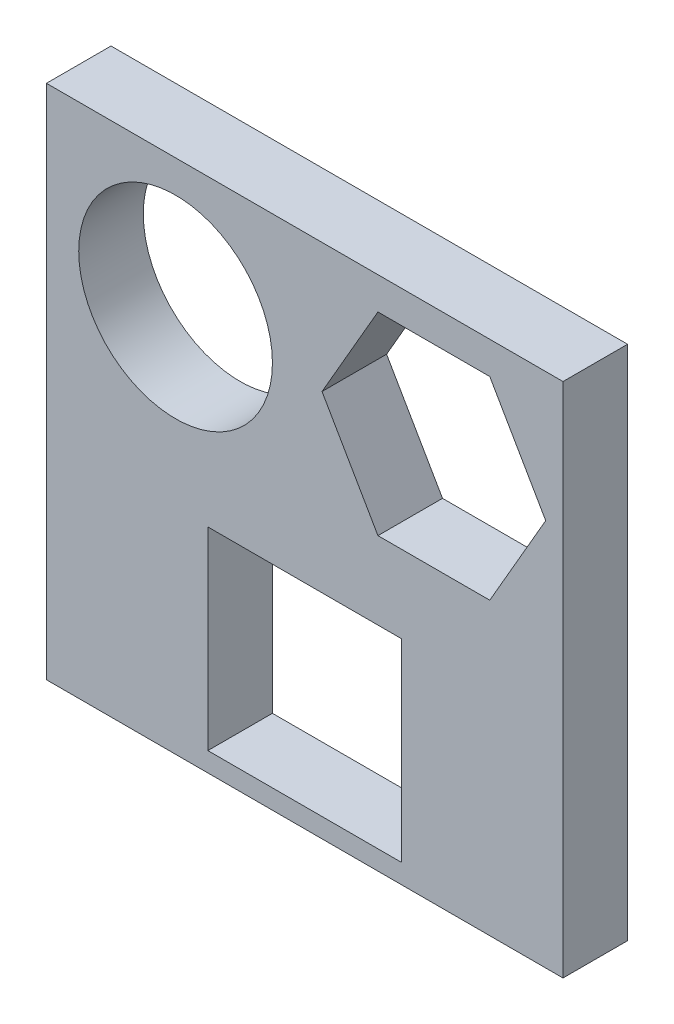
ISO-10303-21;
HEADER;
FILE_DESCRIPTION(('STEP AP214'),'2;1');
FILE_NAME('part.step','',(''),(''),'','','');
FILE_SCHEMA(('AUTOMOTIVE_DESIGN { 1 0 10303 214 1 1 1 1 }'));
ENDSEC;
DATA;
#1=APPLICATION_CONTEXT('core data for automotive mechanical design processes');
#2=APPLICATION_PROTOCOL_DEFINITION('international standard','automotive_design',2000,#1);
#3=PRODUCT_CONTEXT('',#1,'mechanical');
#4=PRODUCT('Part','Part','',(#3));
#5=PRODUCT_RELATED_PRODUCT_CATEGORY('part','',(#4));
#6=PRODUCT_DEFINITION_FORMATION('','',#4);
#7=PRODUCT_DEFINITION_CONTEXT('part definition',#1,'design');
#8=PRODUCT_DEFINITION('design','',#6,#7);
#9=PRODUCT_DEFINITION_SHAPE('','',#8);
#10=(LENGTH_UNIT() NAMED_UNIT(*) SI_UNIT(.MILLI.,.METRE.));
#11=(NAMED_UNIT(*) PLANE_ANGLE_UNIT() SI_UNIT($,.RADIAN.));
#12=(NAMED_UNIT(*) SI_UNIT($,.STERADIAN.) SOLID_ANGLE_UNIT());
#13=UNCERTAINTY_MEASURE_WITH_UNIT(LENGTH_MEASURE(1.E-05),#10,'distance_accuracy_value','');
#14=(GEOMETRIC_REPRESENTATION_CONTEXT(3) GLOBAL_UNCERTAINTY_ASSIGNED_CONTEXT((#13)) GLOBAL_UNIT_ASSIGNED_CONTEXT((#10,
#11,#12)) REPRESENTATION_CONTEXT('',''));
#15=CARTESIAN_POINT('',(0.,0.,0.));
#16=DIRECTION('',(0.,0.,1.));
#17=DIRECTION('',(1.,0.,0.));
#18=AXIS2_PLACEMENT_3D('',#15,#16,#17);
#19=CARTESIAN_POINT('',(40.,-40.,-10.));
#20=DIRECTION('',(1.,0.,0.));
#21=DIRECTION('',(0.,0.,-1.));
#22=AXIS2_PLACEMENT_3D('',#19,#20,#21);
#23=PLANE('',#22);
#24=DIRECTION('',(0.,1.,0.));
#25=VECTOR('',#24,1.);
#26=CARTESIAN_POINT('',(40.,-40.,0.));
#27=LINE('',#26,#25);
#28=CARTESIAN_POINT('',(40.,-40.,0.));
#29=VERTEX_POINT('',#28);
#30=CARTESIAN_POINT('',(40.,40.,0.));
#31=VERTEX_POINT('',#30);
#32=EDGE_CURVE('E260',#29,#31,#27,.T.);
#33=ORIENTED_EDGE('',*,*,#32,.F.);
#34=DIRECTION('',(0.,0.,1.));
#35=VECTOR('',#34,1.);
#36=CARTESIAN_POINT('',(40.,-40.,-10.));
#37=LINE('',#36,#35);
#38=CARTESIAN_POINT('',(40.,-40.,-10.));
#39=VERTEX_POINT('',#38);
#40=EDGE_CURVE('E11',#39,#29,#37,.T.);
#41=ORIENTED_EDGE('',*,*,#40,.F.);
#42=DIRECTION('',(0.,1.,0.));
#43=VECTOR('',#42,1.);
#44=CARTESIAN_POINT('',(40.,-40.,-10.));
#45=LINE('',#44,#43);
#46=CARTESIAN_POINT('',(40.,40.,-10.));
#47=VERTEX_POINT('',#46);
#48=EDGE_CURVE('E264',#39,#47,#45,.T.);
#49=ORIENTED_EDGE('',*,*,#48,.T.);
#50=DIRECTION('',(0.,0.,1.));
#51=VECTOR('',#50,1.);
#52=CARTESIAN_POINT('',(40.,40.,-10.));
#53=LINE('',#52,#51);
#54=EDGE_CURVE('E42',#47,#31,#53,.T.);
#55=ORIENTED_EDGE('',*,*,#54,.T.);
#56=EDGE_LOOP('',(#33,#41,#49,#55));
#57=FACE_BOUND('',#56,.T.);
#58=ADVANCED_FACE('F39',(#57),#23,.T.);
#59=CARTESIAN_POINT('',(-40.,-40.,-10.));
#60=DIRECTION('',(0.,-1.,0.));
#61=DIRECTION('',(0.,0.,-1.));
#62=AXIS2_PLACEMENT_3D('',#59,#60,#61);
#63=PLANE('',#62);
#64=DIRECTION('',(1.,0.,0.));
#65=VECTOR('',#64,1.);
#66=CARTESIAN_POINT('',(-40.,-40.,0.));
#67=LINE('',#66,#65);
#68=CARTESIAN_POINT('',(-40.,-40.,0.));
#69=VERTEX_POINT('',#68);
#70=EDGE_CURVE('E269',#69,#29,#67,.T.);
#71=ORIENTED_EDGE('',*,*,#70,.F.);
#72=DIRECTION('',(0.,0.,1.));
#73=VECTOR('',#72,1.);
#74=CARTESIAN_POINT('',(-40.,-40.,-10.));
#75=LINE('',#74,#73);
#76=CARTESIAN_POINT('',(-40.,-40.,-10.));
#77=VERTEX_POINT('',#76);
#78=EDGE_CURVE('E48',#77,#69,#75,.T.);
#79=ORIENTED_EDGE('',*,*,#78,.F.);
#80=DIRECTION('',(1.,0.,0.));
#81=VECTOR('',#80,1.);
#82=CARTESIAN_POINT('',(-40.,-40.,-10.));
#83=LINE('',#82,#81);
#84=EDGE_CURVE('E277',#77,#39,#83,.T.);
#85=ORIENTED_EDGE('',*,*,#84,.T.);
#86=ORIENTED_EDGE('',*,*,#40,.T.);
#87=EDGE_LOOP('',(#71,#79,#85,#86));
#88=FACE_BOUND('',#87,.T.);
#89=ADVANCED_FACE('F311',(#88),#63,.T.);
#90=CARTESIAN_POINT('',(-40.,-40.,-10.));
#91=DIRECTION('',(-1.,0.,0.));
#92=DIRECTION('',(0.,0.,1.));
#93=AXIS2_PLACEMENT_3D('',#90,#91,#92);
#94=PLANE('',#93);
#95=DIRECTION('',(0.,-1.,0.));
#96=VECTOR('',#95,1.);
#97=CARTESIAN_POINT('',(-40.,-40.,0.));
#98=LINE('',#97,#96);
#99=CARTESIAN_POINT('',(-40.,40.,0.));
#100=VERTEX_POINT('',#99);
#101=EDGE_CURVE('E288',#100,#69,#98,.T.);
#102=ORIENTED_EDGE('',*,*,#101,.F.);
#103=DIRECTION('',(0.,0.,1.));
#104=VECTOR('',#103,1.);
#105=CARTESIAN_POINT('',(-40.,40.,-10.));
#106=LINE('',#105,#104);
#107=CARTESIAN_POINT('',(-40.,40.,-10.));
#108=VERTEX_POINT('',#107);
#109=EDGE_CURVE('E296',#108,#100,#106,.T.);
#110=ORIENTED_EDGE('',*,*,#109,.F.);
#111=DIRECTION('',(0.,-1.,0.));
#112=VECTOR('',#111,1.);
#113=CARTESIAN_POINT('',(-40.,-40.,-10.));
#114=LINE('',#113,#112);
#115=EDGE_CURVE('E273',#108,#77,#114,.T.);
#116=ORIENTED_EDGE('',*,*,#115,.T.);
#117=ORIENTED_EDGE('',*,*,#78,.T.);
#118=EDGE_LOOP('',(#102,#110,#116,#117));
#119=FACE_BOUND('',#118,.T.);
#120=ADVANCED_FACE('F316',(#119),#94,.T.);
#121=CARTESIAN_POINT('',(-40.,40.,-10.));
#122=DIRECTION('',(0.,1.,0.));
#123=DIRECTION('',(0.,0.,1.));
#124=AXIS2_PLACEMENT_3D('',#121,#122,#123);
#125=PLANE('',#124);
#126=DIRECTION('',(-1.,0.,0.));
#127=VECTOR('',#126,1.);
#128=CARTESIAN_POINT('',(-40.,40.,0.));
#129=LINE('',#128,#127);
#130=EDGE_CURVE('E284',#31,#100,#129,.T.);
#131=ORIENTED_EDGE('',*,*,#130,.F.);
#132=ORIENTED_EDGE('',*,*,#54,.F.);
#133=DIRECTION('',(-1.,0.,0.));
#134=VECTOR('',#133,1.);
#135=CARTESIAN_POINT('',(-40.,40.,-10.));
#136=LINE('',#135,#134);
#137=EDGE_CURVE('E268',#47,#108,#136,.T.);
#138=ORIENTED_EDGE('',*,*,#137,.T.);
#139=ORIENTED_EDGE('',*,*,#109,.T.);
#140=EDGE_LOOP('',(#131,#132,#138,#139));
#141=FACE_BOUND('',#140,.T.);
#142=ADVANCED_FACE('F306',(#141),#125,.T.);
#143=CARTESIAN_POINT('',(0.,0.,-10.));
#144=DIRECTION('',(0.,0.,-1.));
#145=DIRECTION('',(-1.,0.,0.));
#146=AXIS2_PLACEMENT_3D('',#143,#144,#145);
#147=PLANE('',#146);
#148=DIRECTION('',(-1.,0.,0.));
#149=VECTOR('',#148,1.);
#150=CARTESIAN_POINT('',(28.6602540378444,35.,-10.));
#151=LINE('',#150,#149);
#152=CARTESIAN_POINT('',(28.6602540378444,35.,-10.));
#153=VERTEX_POINT('',#152);
#154=CARTESIAN_POINT('',(11.3397459621556,35.,-10.));
#155=VERTEX_POINT('',#154);
#156=EDGE_CURVE('E143',#153,#155,#151,.T.);
#157=ORIENTED_EDGE('',*,*,#156,.T.);
#158=DIRECTION('',(-0.5,-0.866025403784439,0.));
#159=VECTOR('',#158,1.);
#160=CARTESIAN_POINT('',(11.3397459621556,35.,-10.));
#161=LINE('',#160,#159);
#162=CARTESIAN_POINT('',(2.67949192431126,20.,-10.));
#163=VERTEX_POINT('',#162);
#164=EDGE_CURVE('E153',#155,#163,#161,.T.);
#165=ORIENTED_EDGE('',*,*,#164,.T.);
#166=DIRECTION('',(0.5,-0.866025403784438,0.));
#167=VECTOR('',#166,1.);
#168=CARTESIAN_POINT('',(2.67949192431126,20.,-10.));
#169=LINE('',#168,#167);
#170=CARTESIAN_POINT('',(11.3397459621557,4.99999999999999,-10.));
#171=VERTEX_POINT('',#170);
#172=EDGE_CURVE('E56',#163,#171,#169,.T.);
#173=ORIENTED_EDGE('',*,*,#172,.T.);
#174=DIRECTION('',(1.,0.,0.));
#175=VECTOR('',#174,1.);
#176=CARTESIAN_POINT('',(11.3397459621557,4.99999999999999,-10.));
#177=LINE('',#176,#175);
#178=CARTESIAN_POINT('',(28.6602540378444,5.00000000000001,-10.));
#179=VERTEX_POINT('',#178);
#180=EDGE_CURVE('E172',#171,#179,#177,.T.);
#181=ORIENTED_EDGE('',*,*,#180,.T.);
#182=DIRECTION('',(0.5,0.866025403784439,0.));
#183=VECTOR('',#182,1.);
#184=CARTESIAN_POINT('',(28.6602540378444,5.00000000000001,-10.));
#185=LINE('',#184,#183);
#186=CARTESIAN_POINT('',(37.3205080756888,20.,-10.));
#187=VERTEX_POINT('',#186);
#188=EDGE_CURVE('E176',#179,#187,#185,.T.);
#189=ORIENTED_EDGE('',*,*,#188,.T.);
#190=DIRECTION('',(-0.500000000000001,0.866025403784438,0.));
#191=VECTOR('',#190,1.);
#192=CARTESIAN_POINT('',(37.3205080756888,20.,-10.));
#193=LINE('',#192,#191);
#194=EDGE_CURVE('E150',#187,#153,#193,.T.);
#195=ORIENTED_EDGE('',*,*,#194,.T.);
#196=EDGE_LOOP('',(#157,#165,#173,#181,#189,#195));
#197=FACE_BOUND('',#196,.T.);
#198=DIRECTION('',(0.,1.,0.));
#199=VECTOR('',#198,1.);
#200=CARTESIAN_POINT('',(15.,-6.99999999999999,-10.));
#201=LINE('',#200,#199);
#202=CARTESIAN_POINT('',(15.,-37.,-10.));
#203=VERTEX_POINT('',#202);
#204=CARTESIAN_POINT('',(15.,-6.99999999999999,-10.));
#205=VERTEX_POINT('',#204);
#206=EDGE_CURVE('E212',#203,#205,#201,.T.);
#207=ORIENTED_EDGE('',*,*,#206,.T.);
#208=DIRECTION('',(-1.,0.,0.));
#209=VECTOR('',#208,1.);
#210=CARTESIAN_POINT('',(-15.,-6.99999999999999,-10.));
#211=LINE('',#210,#209);
#212=CARTESIAN_POINT('',(-15.,-6.99999999999999,-10.));
#213=VERTEX_POINT('',#212);
#214=EDGE_CURVE('E216',#205,#213,#211,.T.);
#215=ORIENTED_EDGE('',*,*,#214,.T.);
#216=DIRECTION('',(0.,-1.,0.));
#217=VECTOR('',#216,1.);
#218=CARTESIAN_POINT('',(-15.,-6.99999999999999,-10.));
#219=LINE('',#218,#217);
#220=CARTESIAN_POINT('',(-15.,-37.,-10.));
#221=VERTEX_POINT('',#220);
#222=EDGE_CURVE('E221',#213,#221,#219,.T.);
#223=ORIENTED_EDGE('',*,*,#222,.T.);
#224=DIRECTION('',(1.,0.,0.));
#225=VECTOR('',#224,1.);
#226=CARTESIAN_POINT('',(-15.,-37.,-10.));
#227=LINE('',#226,#225);
#228=EDGE_CURVE('E225',#221,#203,#227,.T.);
#229=ORIENTED_EDGE('',*,*,#228,.T.);
#230=EDGE_LOOP('',(#207,#215,#223,#229));
#231=FACE_BOUND('',#230,.T.);
#232=CARTESIAN_POINT('',(-20.,20.,-10.));
#233=DIRECTION('',(0.,0.,1.));
#234=DIRECTION('',(1.,0.,0.));
#235=AXIS2_PLACEMENT_3D('',#232,#233,#234);
#236=CIRCLE('',#235,15.);
#237=CARTESIAN_POINT('',(-4.99999999999999,20.,-10.));
#238=VERTEX_POINT('',#237);
#239=EDGE_CURVE('E256',#238,#238,#236,.T.);
#240=ORIENTED_EDGE('',*,*,#239,.T.);
#241=EDGE_LOOP('',(#240));
#242=FACE_BOUND('',#241,.T.);
#243=ORIENTED_EDGE('',*,*,#48,.F.);
#244=ORIENTED_EDGE('',*,*,#84,.F.);
#245=ORIENTED_EDGE('',*,*,#115,.F.);
#246=ORIENTED_EDGE('',*,*,#137,.F.);
#247=EDGE_LOOP('',(#243,#244,#245,#246));
#248=FACE_BOUND('',#247,.T.);
#249=ADVANCED_FACE('F158',(#197,#231,#242,#248),#147,.T.);
#250=CARTESIAN_POINT('',(0.,0.,0.));
#251=DIRECTION('',(0.,0.,-1.));
#252=DIRECTION('',(-1.,0.,0.));
#253=AXIS2_PLACEMENT_3D('',#250,#251,#252);
#254=PLANE('',#253);
#255=DIRECTION('',(-0.5,-0.866025403784439,0.));
#256=VECTOR('',#255,1.);
#257=CARTESIAN_POINT('',(11.3397459621556,35.,0.));
#258=LINE('',#257,#256);
#259=CARTESIAN_POINT('',(11.3397459621556,35.,0.));
#260=VERTEX_POINT('',#259);
#261=CARTESIAN_POINT('',(2.67949192431126,20.,0.));
#262=VERTEX_POINT('',#261);
#263=EDGE_CURVE('E183',#260,#262,#258,.T.);
#264=ORIENTED_EDGE('',*,*,#263,.F.);
#265=DIRECTION('',(-1.,0.,0.));
#266=VECTOR('',#265,1.);
#267=CARTESIAN_POINT('',(28.6602540378444,35.,0.));
#268=LINE('',#267,#266);
#269=CARTESIAN_POINT('',(28.6602540378444,35.,0.));
#270=VERTEX_POINT('',#269);
#271=EDGE_CURVE('E64',#270,#260,#268,.T.);
#272=ORIENTED_EDGE('',*,*,#271,.F.);
#273=DIRECTION('',(-0.500000000000001,0.866025403784438,0.));
#274=VECTOR('',#273,1.);
#275=CARTESIAN_POINT('',(37.3205080756888,20.,0.));
#276=LINE('',#275,#274);
#277=CARTESIAN_POINT('',(37.3205080756888,20.,0.));
#278=VERTEX_POINT('',#277);
#279=EDGE_CURVE('E163',#278,#270,#276,.T.);
#280=ORIENTED_EDGE('',*,*,#279,.F.);
#281=DIRECTION('',(0.5,0.866025403784439,0.));
#282=VECTOR('',#281,1.);
#283=CARTESIAN_POINT('',(28.6602540378444,5.00000000000001,0.));
#284=LINE('',#283,#282);
#285=CARTESIAN_POINT('',(28.6602540378444,5.00000000000001,0.));
#286=VERTEX_POINT('',#285);
#287=EDGE_CURVE('E167',#286,#278,#284,.T.);
#288=ORIENTED_EDGE('',*,*,#287,.F.);
#289=DIRECTION('',(1.,0.,0.));
#290=VECTOR('',#289,1.);
#291=CARTESIAN_POINT('',(11.3397459621557,4.99999999999999,0.));
#292=LINE('',#291,#290);
#293=CARTESIAN_POINT('',(11.3397459621557,4.99999999999999,0.));
#294=VERTEX_POINT('',#293);
#295=EDGE_CURVE('E190',#294,#286,#292,.T.);
#296=ORIENTED_EDGE('',*,*,#295,.F.);
#297=DIRECTION('',(0.5,-0.866025403784438,0.));
#298=VECTOR('',#297,1.);
#299=CARTESIAN_POINT('',(2.67949192431126,20.,0.));
#300=LINE('',#299,#298);
#301=EDGE_CURVE('E186',#262,#294,#300,.T.);
#302=ORIENTED_EDGE('',*,*,#301,.F.);
#303=EDGE_LOOP('',(#264,#272,#280,#288,#296,#302));
#304=FACE_BOUND('',#303,.T.);
#305=DIRECTION('',(-1.,0.,0.));
#306=VECTOR('',#305,1.);
#307=CARTESIAN_POINT('',(-15.,-6.99999999999999,0.));
#308=LINE('',#307,#306);
#309=CARTESIAN_POINT('',(15.,-6.99999999999999,0.));
#310=VERTEX_POINT('',#309);
#311=CARTESIAN_POINT('',(-15.,-6.99999999999999,0.));
#312=VERTEX_POINT('',#311);
#313=EDGE_CURVE('E232',#310,#312,#308,.T.);
#314=ORIENTED_EDGE('',*,*,#313,.F.);
#315=DIRECTION('',(0.,1.,0.));
#316=VECTOR('',#315,1.);
#317=CARTESIAN_POINT('',(15.,-6.99999999999999,0.));
#318=LINE('',#317,#316);
#319=CARTESIAN_POINT('',(15.,-37.,0.));
#320=VERTEX_POINT('',#319);
#321=EDGE_CURVE('E200',#320,#310,#318,.T.);
#322=ORIENTED_EDGE('',*,*,#321,.F.);
#323=DIRECTION('',(1.,0.,0.));
#324=VECTOR('',#323,1.);
#325=CARTESIAN_POINT('',(-15.,-37.,0.));
#326=LINE('',#325,#324);
#327=CARTESIAN_POINT('',(-15.,-37.,0.));
#328=VERTEX_POINT('',#327);
#329=EDGE_CURVE('E217',#328,#320,#326,.T.);
#330=ORIENTED_EDGE('',*,*,#329,.F.);
#331=DIRECTION('',(0.,-1.,0.));
#332=VECTOR('',#331,1.);
#333=CARTESIAN_POINT('',(-15.,-6.99999999999999,0.));
#334=LINE('',#333,#332);
#335=EDGE_CURVE('E236',#312,#328,#334,.T.);
#336=ORIENTED_EDGE('',*,*,#335,.F.);
#337=EDGE_LOOP('',(#314,#322,#330,#336));
#338=FACE_BOUND('',#337,.T.);
#339=CARTESIAN_POINT('',(-20.,20.,0.));
#340=DIRECTION('',(0.,0.,1.));
#341=DIRECTION('',(1.,0.,0.));
#342=AXIS2_PLACEMENT_3D('',#339,#340,#341);
#343=CIRCLE('',#342,15.);
#344=CARTESIAN_POINT('',(-4.99999999999999,20.,0.));
#345=VERTEX_POINT('',#344);
#346=EDGE_CURVE('E246',#345,#345,#343,.T.);
#347=ORIENTED_EDGE('',*,*,#346,.F.);
#348=EDGE_LOOP('',(#347));
#349=FACE_BOUND('',#348,.T.);
#350=ORIENTED_EDGE('',*,*,#32,.T.);
#351=ORIENTED_EDGE('',*,*,#130,.T.);
#352=ORIENTED_EDGE('',*,*,#101,.T.);
#353=ORIENTED_EDGE('',*,*,#70,.T.);
#354=EDGE_LOOP('',(#350,#351,#352,#353));
#355=FACE_BOUND('',#354,.T.);
#356=ADVANCED_FACE('F308',(#304,#338,#349,#355),#254,.F.);
#357=CARTESIAN_POINT('',(-20.,20.,-10.));
#358=DIRECTION('',(0.,0.,1.));
#359=DIRECTION('',(1.,0.,0.));
#360=AXIS2_PLACEMENT_3D('',#357,#358,#359);
#361=CYLINDRICAL_SURFACE('',#360,15.);
#362=ORIENTED_EDGE('',*,*,#239,.F.);
#363=EDGE_LOOP('',(#362));
#364=FACE_BOUND('',#363,.T.);
#365=ORIENTED_EDGE('',*,*,#346,.T.);
#366=EDGE_LOOP('',(#365));
#367=FACE_BOUND('',#366,.T.);
#368=ADVANCED_FACE('F358',(#364,#367),#361,.F.);
#369=CARTESIAN_POINT('',(15.,-6.99999999999999,-10.));
#370=DIRECTION('',(1.,0.,0.));
#371=DIRECTION('',(0.,1.,0.));
#372=AXIS2_PLACEMENT_3D('',#369,#370,#371);
#373=PLANE('',#372);
#374=ORIENTED_EDGE('',*,*,#321,.T.);
#375=DIRECTION('',(0.,0.,1.));
#376=VECTOR('',#375,1.);
#377=CARTESIAN_POINT('',(15.,-6.99999999999999,-10.));
#378=LINE('',#377,#376);
#379=EDGE_CURVE('E229',#205,#310,#378,.T.);
#380=ORIENTED_EDGE('',*,*,#379,.F.);
#381=ORIENTED_EDGE('',*,*,#206,.F.);
#382=DIRECTION('',(0.,0.,1.));
#383=VECTOR('',#382,1.);
#384=CARTESIAN_POINT('',(15.,-37.,-10.));
#385=LINE('',#384,#383);
#386=EDGE_CURVE('E243',#203,#320,#385,.T.);
#387=ORIENTED_EDGE('',*,*,#386,.T.);
#388=EDGE_LOOP('',(#374,#380,#381,#387));
#389=FACE_BOUND('',#388,.T.);
#390=ADVANCED_FACE('F368',(#389),#373,.F.);
#391=CARTESIAN_POINT('',(-15.,-37.,-10.));
#392=DIRECTION('',(0.,-1.,0.));
#393=DIRECTION('',(0.,0.,-1.));
#394=AXIS2_PLACEMENT_3D('',#391,#392,#393);
#395=PLANE('',#394);
#396=ORIENTED_EDGE('',*,*,#329,.T.);
#397=ORIENTED_EDGE('',*,*,#386,.F.);
#398=ORIENTED_EDGE('',*,*,#228,.F.);
#399=DIRECTION('',(0.,0.,1.));
#400=VECTOR('',#399,1.);
#401=CARTESIAN_POINT('',(-15.,-37.,-10.));
#402=LINE('',#401,#400);
#403=EDGE_CURVE('E247',#221,#328,#402,.T.);
#404=ORIENTED_EDGE('',*,*,#403,.T.);
#405=EDGE_LOOP('',(#396,#397,#398,#404));
#406=FACE_BOUND('',#405,.T.);
#407=ADVANCED_FACE('F378',(#406),#395,.F.);
#408=CARTESIAN_POINT('',(-15.,-6.99999999999999,-10.));
#409=DIRECTION('',(-1.,0.,0.));
#410=DIRECTION('',(0.,-1.,0.));
#411=AXIS2_PLACEMENT_3D('',#408,#409,#410);
#412=PLANE('',#411);
#413=ORIENTED_EDGE('',*,*,#335,.T.);
#414=ORIENTED_EDGE('',*,*,#403,.F.);
#415=ORIENTED_EDGE('',*,*,#222,.F.);
#416=DIRECTION('',(0.,0.,1.));
#417=VECTOR('',#416,1.);
#418=CARTESIAN_POINT('',(-15.,-6.99999999999999,-10.));
#419=LINE('',#418,#417);
#420=EDGE_CURVE('E250',#213,#312,#419,.T.);
#421=ORIENTED_EDGE('',*,*,#420,.T.);
#422=EDGE_LOOP('',(#413,#414,#415,#421));
#423=FACE_BOUND('',#422,.T.);
#424=ADVANCED_FACE('F388',(#423),#412,.F.);
#425=CARTESIAN_POINT('',(-15.,-6.99999999999999,-10.));
#426=DIRECTION('',(0.,1.,0.));
#427=DIRECTION('',(0.,0.,1.));
#428=AXIS2_PLACEMENT_3D('',#425,#426,#427);
#429=PLANE('',#428);
#430=ORIENTED_EDGE('',*,*,#313,.T.);
#431=ORIENTED_EDGE('',*,*,#420,.F.);
#432=ORIENTED_EDGE('',*,*,#214,.F.);
#433=ORIENTED_EDGE('',*,*,#379,.T.);
#434=EDGE_LOOP('',(#430,#431,#432,#433));
#435=FACE_BOUND('',#434,.T.);
#436=ADVANCED_FACE('F398',(#435),#429,.F.);
#437=CARTESIAN_POINT('',(28.6602540378444,35.,-10.));
#438=DIRECTION('',(0.,1.,0.));
#439=DIRECTION('',(0.,0.,1.));
#440=AXIS2_PLACEMENT_3D('',#437,#438,#439);
#441=PLANE('',#440);
#442=ORIENTED_EDGE('',*,*,#271,.T.);
#443=DIRECTION('',(0.,0.,1.));
#444=VECTOR('',#443,1.);
#445=CARTESIAN_POINT('',(11.3397459621556,35.,-10.));
#446=LINE('',#445,#444);
#447=EDGE_CURVE('E139',#155,#260,#446,.T.);
#448=ORIENTED_EDGE('',*,*,#447,.F.);
#449=ORIENTED_EDGE('',*,*,#156,.F.);
#450=DIRECTION('',(0.,0.,1.));
#451=VECTOR('',#450,1.);
#452=CARTESIAN_POINT('',(28.6602540378444,35.,-10.));
#453=LINE('',#452,#451);
#454=EDGE_CURVE('E197',#153,#270,#453,.T.);
#455=ORIENTED_EDGE('',*,*,#454,.T.);
#456=EDGE_LOOP('',(#442,#448,#449,#455));
#457=FACE_BOUND('',#456,.T.);
#458=ADVANCED_FACE('F141',(#457),#441,.F.);
#459=CARTESIAN_POINT('',(37.3205080756888,20.,-10.));
#460=DIRECTION('',(0.866025403784438,0.500000000000001,0.));
#461=DIRECTION('',(-0.500000000000001,0.866025403784438,0.));
#462=AXIS2_PLACEMENT_3D('',#459,#460,#461);
#463=PLANE('',#462);
#464=ORIENTED_EDGE('',*,*,#279,.T.);
#465=ORIENTED_EDGE('',*,*,#454,.F.);
#466=ORIENTED_EDGE('',*,*,#194,.F.);
#467=DIRECTION('',(0.,0.,1.));
#468=VECTOR('',#467,1.);
#469=CARTESIAN_POINT('',(37.3205080756888,20.,-10.));
#470=LINE('',#469,#468);
#471=EDGE_CURVE('E201',#187,#278,#470,.T.);
#472=ORIENTED_EDGE('',*,*,#471,.T.);
#473=EDGE_LOOP('',(#464,#465,#466,#472));
#474=FACE_BOUND('',#473,.T.);
#475=ADVANCED_FACE('F417',(#474),#463,.F.);
#476=CARTESIAN_POINT('',(28.6602540378444,5.00000000000001,-10.));
#477=DIRECTION('',(0.866025403784439,-0.5,0.));
#478=DIRECTION('',(0.5,0.866025403784439,0.));
#479=AXIS2_PLACEMENT_3D('',#476,#477,#478);
#480=PLANE('',#479);
#481=ORIENTED_EDGE('',*,*,#287,.T.);
#482=ORIENTED_EDGE('',*,*,#471,.F.);
#483=ORIENTED_EDGE('',*,*,#188,.F.);
#484=DIRECTION('',(0.,0.,1.));
#485=VECTOR('',#484,1.);
#486=CARTESIAN_POINT('',(28.6602540378444,5.00000000000001,-10.));
#487=LINE('',#486,#485);
#488=EDGE_CURVE('E204',#179,#286,#487,.T.);
#489=ORIENTED_EDGE('',*,*,#488,.T.);
#490=EDGE_LOOP('',(#481,#482,#483,#489));
#491=FACE_BOUND('',#490,.T.);
#492=ADVANCED_FACE('F426',(#491),#480,.F.);
#493=CARTESIAN_POINT('',(11.3397459621557,4.99999999999999,-10.));
#494=DIRECTION('',(0.,-1.,0.));
#495=DIRECTION('',(1.,0.,0.));
#496=AXIS2_PLACEMENT_3D('',#493,#494,#495);
#497=PLANE('',#496);
#498=ORIENTED_EDGE('',*,*,#295,.T.);
#499=ORIENTED_EDGE('',*,*,#488,.F.);
#500=ORIENTED_EDGE('',*,*,#180,.F.);
#501=DIRECTION('',(0.,0.,1.));
#502=VECTOR('',#501,1.);
#503=CARTESIAN_POINT('',(11.3397459621557,4.99999999999999,-10.));
#504=LINE('',#503,#502);
#505=EDGE_CURVE('E207',#171,#294,#504,.T.);
#506=ORIENTED_EDGE('',*,*,#505,.T.);
#507=EDGE_LOOP('',(#498,#499,#500,#506));
#508=FACE_BOUND('',#507,.T.);
#509=ADVANCED_FACE('F436',(#508),#497,.F.);
#510=CARTESIAN_POINT('',(2.67949192431126,20.,-10.));
#511=DIRECTION('',(-0.866025403784438,-0.5,0.));
#512=DIRECTION('',(0.5,-0.866025403784438,0.));
#513=AXIS2_PLACEMENT_3D('',#510,#511,#512);
#514=PLANE('',#513);
#515=ORIENTED_EDGE('',*,*,#301,.T.);
#516=ORIENTED_EDGE('',*,*,#505,.F.);
#517=ORIENTED_EDGE('',*,*,#172,.F.);
#518=DIRECTION('',(0.,0.,1.));
#519=VECTOR('',#518,1.);
#520=CARTESIAN_POINT('',(2.67949192431126,20.,-10.));
#521=LINE('',#520,#519);
#522=EDGE_CURVE('E149',#163,#262,#521,.T.);
#523=ORIENTED_EDGE('',*,*,#522,.T.);
#524=EDGE_LOOP('',(#515,#516,#517,#523));
#525=FACE_BOUND('',#524,.T.);
#526=ADVANCED_FACE('F446',(#525),#514,.F.);
#527=CARTESIAN_POINT('',(11.3397459621556,35.,-10.));
#528=DIRECTION('',(-0.866025403784439,0.5,0.));
#529=DIRECTION('',(-0.5,-0.866025403784439,0.));
#530=AXIS2_PLACEMENT_3D('',#527,#528,#529);
#531=PLANE('',#530);
#532=ORIENTED_EDGE('',*,*,#263,.T.);
#533=ORIENTED_EDGE('',*,*,#522,.F.);
#534=ORIENTED_EDGE('',*,*,#164,.F.);
#535=ORIENTED_EDGE('',*,*,#447,.T.);
#536=EDGE_LOOP('',(#532,#533,#534,#535));
#537=FACE_BOUND('',#536,.T.);
#538=ADVANCED_FACE('F154',(#537),#531,.F.);
#539=CLOSED_SHELL('',(#58,#89,#120,#142,#249,#356,#368,#390,#407,#424,#436,#458,#475,#492,#509,
#526,#538));
#540=MANIFOLD_SOLID_BREP('B2',#539);
#541=ADVANCED_BREP_SHAPE_REPRESENTATION('',(#18,#540),#14);
#542=SHAPE_DEFINITION_REPRESENTATION(#9,#541);
ENDSEC;
END-ISO-10303-21;
